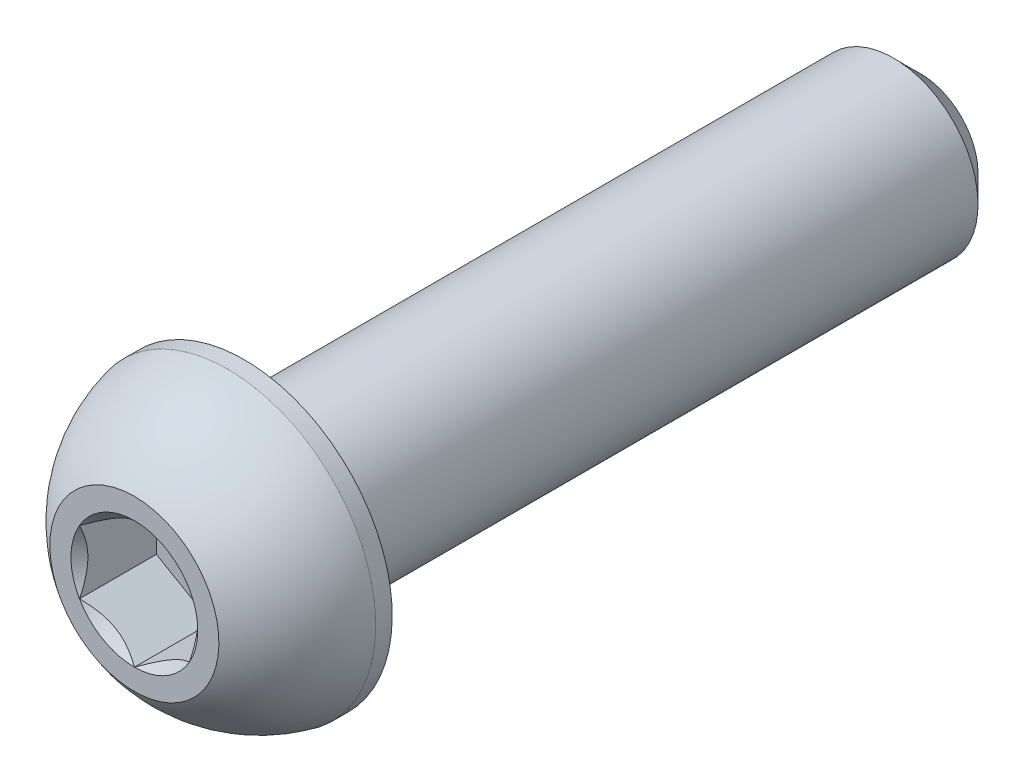
ISO-10303-21;
HEADER;
FILE_DESCRIPTION(('STEP AP214'),'2;1');
FILE_NAME('part.step','',(''),(''),'','','');
FILE_SCHEMA(('AUTOMOTIVE_DESIGN { 1 0 10303 214 1 1 1 1 }'));
ENDSEC;
DATA;
#1=APPLICATION_CONTEXT('core data for automotive mechanical design processes');
#2=APPLICATION_PROTOCOL_DEFINITION('international standard','automotive_design',2000,#1);
#3=PRODUCT_CONTEXT('',#1,'mechanical');
#4=PRODUCT('Part','Part','',(#3));
#5=PRODUCT_RELATED_PRODUCT_CATEGORY('part','',(#4));
#6=PRODUCT_DEFINITION_FORMATION('','',#4);
#7=PRODUCT_DEFINITION_CONTEXT('part definition',#1,'design');
#8=PRODUCT_DEFINITION('design','',#6,#7);
#9=PRODUCT_DEFINITION_SHAPE('','',#8);
#10=(LENGTH_UNIT() NAMED_UNIT(*) SI_UNIT(.MILLI.,.METRE.));
#11=(NAMED_UNIT(*) PLANE_ANGLE_UNIT() SI_UNIT($,.RADIAN.));
#12=(NAMED_UNIT(*) SI_UNIT($,.STERADIAN.) SOLID_ANGLE_UNIT());
#13=UNCERTAINTY_MEASURE_WITH_UNIT(LENGTH_MEASURE(1.E-05),#10,'distance_accuracy_value','');
#14=(GEOMETRIC_REPRESENTATION_CONTEXT(3) GLOBAL_UNCERTAINTY_ASSIGNED_CONTEXT((#13)) GLOBAL_UNIT_ASSIGNED_CONTEXT((#10,
#11,#12)) REPRESENTATION_CONTEXT('',''));
#15=CARTESIAN_POINT('',(0.,0.,0.));
#16=DIRECTION('',(0.,0.,1.));
#17=DIRECTION('',(1.,0.,0.));
#18=AXIS2_PLACEMENT_3D('',#15,#16,#17);
#19=CARTESIAN_POINT('',(0.,0.,4.65));
#20=DIRECTION('',(0.,0.,-1.));
#21=DIRECTION('',(0.,1.,0.));
#22=AXIS2_PLACEMENT_3D('',#19,#20,#21);
#23=PLANE('',#22);
#24=CARTESIAN_POINT('',(0.,0.,4.65));
#25=DIRECTION('',(0.,0.,1.));
#26=DIRECTION('',(1.,0.,0.));
#27=AXIS2_PLACEMENT_3D('',#24,#25,#26);
#28=CIRCLE('',#27,0.750555349946514);
#29=CARTESIAN_POINT('',(0.,0.750555349946514,4.65));
#30=VERTEX_POINT('',#29);
#31=CARTESIAN_POINT('',(-0.65,0.375277674973257,4.65));
#32=VERTEX_POINT('',#31);
#33=EDGE_CURVE('E213',#30,#32,#28,.T.);
#34=ORIENTED_EDGE('',*,*,#33,.F.);
#35=CARTESIAN_POINT('',(0.65,0.375277674973257,4.65));
#36=VERTEX_POINT('',#35);
#37=EDGE_CURVE('E215',#36,#30,#28,.T.);
#38=ORIENTED_EDGE('',*,*,#37,.F.);
#39=CARTESIAN_POINT('',(0.65,-0.375277674973256,4.65));
#40=VERTEX_POINT('',#39);
#41=EDGE_CURVE('E54',#40,#36,#28,.T.);
#42=ORIENTED_EDGE('',*,*,#41,.F.);
#43=CARTESIAN_POINT('',(0.,-0.750555349946513,4.65));
#44=VERTEX_POINT('',#43);
#45=EDGE_CURVE('E61',#44,#40,#28,.T.);
#46=ORIENTED_EDGE('',*,*,#45,.F.);
#47=CARTESIAN_POINT('',(-0.65,-0.375277674973257,4.65));
#48=VERTEX_POINT('',#47);
#49=EDGE_CURVE('E220',#48,#44,#28,.T.);
#50=ORIENTED_EDGE('',*,*,#49,.F.);
#51=EDGE_CURVE('E217',#32,#48,#28,.T.);
#52=ORIENTED_EDGE('',*,*,#51,.F.);
#53=EDGE_LOOP('',(#34,#38,#42,#46,#50,#52));
#54=FACE_BOUND('',#53,.T.);
#55=CARTESIAN_POINT('',(0.,0.,4.65));
#56=DIRECTION('',(0.,0.,1.));
#57=DIRECTION('',(0.,-1.,0.));
#58=AXIS2_PLACEMENT_3D('',#55,#56,#57);
#59=CIRCLE('',#58,0.999999999999998);
#60=CARTESIAN_POINT('',(0.,0.999999999999999,4.65));
#61=VERTEX_POINT('',#60);
#62=EDGE_CURVE('E48',#61,#61,#59,.T.);
#63=ORIENTED_EDGE('',*,*,#62,.T.);
#64=EDGE_LOOP('',(#63));
#65=FACE_BOUND('',#64,.T.);
#66=ADVANCED_FACE('F35',(#54,#65),#23,.F.);
#67=CARTESIAN_POINT('',(0.,0.,3.16424208144796));
#68=DIRECTION('',(0.,0.,1.));
#69=DIRECTION('',(0.,1.,0.));
#70=AXIS2_PLACEMENT_3D('',#67,#68,#69);
#71=SPHERICAL_SURFACE('',#70,1.790942933915);
#72=CARTESIAN_POINT('',(0.,0.,3.545));
#73=DIRECTION('',(0.,0.,1.));
#74=DIRECTION('',(0.,-1.,0.));
#75=AXIS2_PLACEMENT_3D('',#72,#73,#74);
#76=CIRCLE('',#75,1.75);
#77=CARTESIAN_POINT('',(0.,1.75,3.545));
#78=VERTEX_POINT('',#77);
#79=EDGE_CURVE('E160',#78,#78,#76,.T.);
#80=CARTESIAN_POINT('',(0.,0.999999999999999,4.65));
#81=CARTESIAN_POINT('',(0.,1.01182643004196,4.6420401786267));
#82=CARTESIAN_POINT('',(0.,1.02355778185812,4.63393909660818));
#83=CARTESIAN_POINT('',(0.,1.04682372823726,4.61745915548289));
#84=CARTESIAN_POINT('',(0.,1.05835832280024,4.60908029637612));
#85=CARTESIAN_POINT('',(0.,1.08122415387148,4.59204954527652));
#86=CARTESIAN_POINT('',(0.,1.09255539037973,4.58339765328368));
#87=CARTESIAN_POINT('',(0.,1.11500805055768,4.56582577873956));
#88=CARTESIAN_POINT('',(0.,1.12612947422737,4.55690579618828));
#89=CARTESIAN_POINT('',(0.,1.14815616552582,4.53880282434977));
#90=CARTESIAN_POINT('',(0.,1.15906143315459,4.52961983506255));
#91=CARTESIAN_POINT('',(0.,1.18064959458057,4.51099608658973));
#92=CARTESIAN_POINT('',(0.,1.1913324883778,4.50155532740413));
#93=CARTESIAN_POINT('',(0.,1.21246981057064,4.48242142213754));
#94=CARTESIAN_POINT('',(0.,1.22292423896625,4.47272827605656));
#95=CARTESIAN_POINT('',(0.,1.24359866921302,4.45309512413341));
#96=CARTESIAN_POINT('',(0.,1.25381867106419,4.44315511829126));
#97=CARTESIAN_POINT('',(0.,1.2740184207091,4.42303391468225));
#98=CARTESIAN_POINT('',(0.,1.28399816850284,4.4128527169154));
#99=CARTESIAN_POINT('',(0.,1.30371171952532,4.39225493483821));
#100=CARTESIAN_POINT('',(0.,1.31344552275404,4.38183835052787));
#101=CARTESIAN_POINT('',(0.,1.33266163437492,4.36077573495947));
#102=CARTESIAN_POINT('',(0.,1.34214394276706,4.35012970370141));
#103=CARTESIAN_POINT('',(0.,1.36085165784782,4.32861426466644));
#104=CARTESIAN_POINT('',(0.,1.37007706453643,4.31774485688953));
#105=CARTESIAN_POINT('',(0.,1.38826571582979,4.29578886261603));
#106=CARTESIAN_POINT('',(0.,1.39722896043454,4.28470227611943));
#107=CARTESIAN_POINT('',(0.,1.41488817666623,4.26231824604234));
#108=CARTESIAN_POINT('',(0.,1.42358414829318,4.25102080246185));
#109=CARTESIAN_POINT('',(0.,1.44070386007592,4.22822150008468));
#110=CARTESIAN_POINT('',(0.,1.44912760023172,4.216719641288));
#111=CARTESIAN_POINT('',(0.,1.46569804580677,4.19351806690492));
#112=CARTESIAN_POINT('',(0.,1.47384475122603,4.18181835131851));
#113=CARTESIAN_POINT('',(0.,1.48985648202944,4.15822773460149));
#114=CARTESIAN_POINT('',(0.,1.49772150741358,4.14633683347089));
#115=CARTESIAN_POINT('',(0.,1.51316539346376,4.12237062592613));
#116=CARTESIAN_POINT('',(0.,1.5207442541298,4.11029531951197));
#117=CARTESIAN_POINT('',(0.,1.53561148923355,4.08596718680969));
#118=CARTESIAN_POINT('',(0.,1.54289986367127,4.07371436052158));
#119=CARTESIAN_POINT('',(0.,1.5571819704451,4.04903817470386));
#120=CARTESIAN_POINT('',(0.,1.56417570278122,4.03661481517425));
#121=CARTESIAN_POINT('',(0.,1.57786453748518,4.01160464674505));
#122=CARTESIAN_POINT('',(0.,1.58455963985302,3.99901783784545));
#123=CARTESIAN_POINT('',(0.,1.59764739703439,3.97368794774755));
#124=CARTESIAN_POINT('',(0.,1.60404005184792,3.96094486654925));
#125=CARTESIAN_POINT('',(0.,1.61651926879161,3.93530969803253));
#126=CARTESIAN_POINT('',(0.,1.62260583092176,3.92241761071411));
#127=CARTESIAN_POINT('',(0.,1.63446939190682,3.89649178110021));
#128=CARTESIAN_POINT('',(0.,1.64024639076172,3.88345803880473));
#129=CARTESIAN_POINT('',(0.,1.65148753111412,3.85725633115103));
#130=CARTESIAN_POINT('',(0.,1.65695167261162,3.84408836579282));
#131=CARTESIAN_POINT('',(0.,1.66756398257887,3.81762572046729));
#132=CARTESIAN_POINT('',(0.,1.67271215104863,3.80433104049997));
#133=CARTESIAN_POINT('',(0.,1.68268957938988,3.77762254664633));
#134=CARTESIAN_POINT('',(0.,1.68751883926138,3.76420873276001));
#135=CARTESIAN_POINT('',(0.,1.69685569693965,3.73726961975255));
#136=CARTESIAN_POINT('',(0.,1.70136329474643,3.7237443206314));
#137=CARTESIAN_POINT('',(0.,1.71005425727009,3.696589949172));
#138=CARTESIAN_POINT('',(0.,1.71423762198697,3.68296087683374));
#139=CARTESIAN_POINT('',(0.,1.72227773581391,3.65560673101066));
#140=CARTESIAN_POINT('',(0.,1.72613448492398,3.64188165752584));
#141=CARTESIAN_POINT('',(0.,1.73351915771601,3.61434333293356));
#142=CARTESIAN_POINT('',(0.,1.73704708139798,3.60053008182609));
#143=CARTESIAN_POINT('',(0.,1.74377213155194,3.57282328805928));
#144=CARTESIAN_POINT('',(0.,1.74696925802394,3.55892974539993));
#145=CARTESIAN_POINT('',(0.,1.75,3.545));
#146=B_SPLINE_CURVE_WITH_KNOTS('',3,(#80,#81,#82,#83,#84,#85,#86,#87,#88,#89,#90,#91,#92,#93,
#94,#95,#96,#97,#98,#99,#100,#101,#102,#103,#104,#105,#106,#107,#108,#109,#110,#111,#112,#113,
#114,#115,#116,#117,#118,#119,#120,#121,#122,#123,#124,#125,#126,#127,#128,#129,#130,#131,#132,
#133,#134,#135,#136,#137,#138,#139,#140,#141,#142,#143,#144,#145),.UNSPECIFIED.,.F.,.F.,(4,2,2,
2,2,2,2,2,2,2,2,2,2,2,2,2,2,2,2,2,2,2,2,2,2,2,2,2,2,2,2,2,4),(0.,0.0427658943058255,
0.085531788611652,0.128297682917478,0.171063577223304,0.21382947152913,0.256595365834956,
0.299361260140783,0.342127154446609,0.384893048752435,0.427658943058261,0.470424837364087,
0.513190731669913,0.555956625975739,0.598722520281566,0.641488414587392,0.684254308893218,
0.727020203199044,0.76978609750487,0.812551991810697,0.855317886116523,0.898083780422348,
0.940849674728175,0.983615569034001,1.02638146333983,1.06914735764565,1.11191325195148,
1.15467914625731,1.19744504056313,1.24021093486896,1.28297682917478,1.32574272348061,
1.36850861778644),.UNSPECIFIED.);
#147=EDGE_CURVE('BSEAM166',#61,#78,#146,.T.);
#148=ORIENTED_EDGE('',*,*,#62,.F.);
#149=ORIENTED_EDGE('',*,*,#79,.T.);
#150=ORIENTED_EDGE('',*,*,#147,.T.);
#151=ORIENTED_EDGE('',*,*,#147,.F.);
#152=EDGE_LOOP('',(#148,#150,#149,#151));
#153=FACE_BOUND('',#152,.T.);
#154=ADVANCED_FACE('F166',(#153),#71,.T.);
#155=CARTESIAN_POINT('',(0.,0.,4.65));
#156=DIRECTION('',(0.,0.,1.));
#157=DIRECTION('',(0.,-1.,0.));
#158=AXIS2_PLACEMENT_3D('',#155,#156,#157);
#159=CYLINDRICAL_SURFACE('',#158,1.75);
#160=ORIENTED_EDGE('',*,*,#79,.F.);
#161=EDGE_LOOP('',(#160));
#162=FACE_BOUND('',#161,.T.);
#163=CARTESIAN_POINT('',(0.,0.,3.35));
#164=DIRECTION('',(0.,0.,1.));
#165=DIRECTION('',(0.,-1.,0.));
#166=AXIS2_PLACEMENT_3D('',#163,#164,#165);
#167=CIRCLE('',#166,1.75);
#168=CARTESIAN_POINT('',(0.,-1.75,3.35));
#169=VERTEX_POINT('',#168);
#170=EDGE_CURVE('E157',#169,#169,#167,.T.);
#171=ORIENTED_EDGE('',*,*,#170,.T.);
#172=EDGE_LOOP('',(#171));
#173=FACE_BOUND('',#172,.T.);
#174=ADVANCED_FACE('F169',(#162,#173),#159,.T.);
#175=CARTESIAN_POINT('',(0.,0.999999999999998,3.35));
#176=DIRECTION('',(0.,0.,1.));
#177=DIRECTION('',(0.,-1.,0.));
#178=AXIS2_PLACEMENT_3D('',#175,#176,#177);
#179=PLANE('',#178);
#180=ORIENTED_EDGE('',*,*,#170,.F.);
#181=EDGE_LOOP('',(#180));
#182=FACE_BOUND('',#181,.T.);
#183=CARTESIAN_POINT('',(0.,0.,3.35));
#184=DIRECTION('',(0.,0.,1.));
#185=DIRECTION('',(0.,-1.,0.));
#186=AXIS2_PLACEMENT_3D('',#183,#184,#185);
#187=CIRCLE('',#186,0.999999999999997);
#188=CARTESIAN_POINT('',(0.,-0.999999999999997,3.35));
#189=VERTEX_POINT('',#188);
#190=EDGE_CURVE('E154',#189,#189,#187,.T.);
#191=ORIENTED_EDGE('',*,*,#190,.T.);
#192=EDGE_LOOP('',(#191));
#193=FACE_BOUND('',#192,.T.);
#194=ADVANCED_FACE('F174',(#182,#193),#179,.F.);
#195=CARTESIAN_POINT('',(0.,0.,4.65));
#196=DIRECTION('',(0.,0.,1.));
#197=DIRECTION('',(0.,-1.,0.));
#198=AXIS2_PLACEMENT_3D('',#195,#196,#197);
#199=CYLINDRICAL_SURFACE('',#198,0.999999999999998);
#200=ORIENTED_EDGE('',*,*,#190,.F.);
#201=EDGE_LOOP('',(#200));
#202=FACE_BOUND('',#201,.T.);
#203=CARTESIAN_POINT('',(0.,0.,-4.33));
#204=DIRECTION('',(0.,0.,1.));
#205=DIRECTION('',(0.,-1.,0.));
#206=AXIS2_PLACEMENT_3D('',#203,#204,#205);
#207=CIRCLE('',#206,0.999999999999998);
#208=CARTESIAN_POINT('',(0.,-0.999999999999997,-4.33));
#209=VERTEX_POINT('',#208);
#210=EDGE_CURVE('E151',#209,#209,#207,.T.);
#211=ORIENTED_EDGE('',*,*,#210,.T.);
#212=EDGE_LOOP('',(#211));
#213=FACE_BOUND('',#212,.T.);
#214=ADVANCED_FACE('F180',(#202,#213),#199,.T.);
#215=CARTESIAN_POINT('',(0.,0.,-4.65));
#216=DIRECTION('',(0.,0.,1.));
#217=DIRECTION('',(0.,-1.,0.));
#218=AXIS2_PLACEMENT_3D('',#215,#216,#217);
#219=CONICAL_SURFACE('',#218,0.680000000000003,0.78539816339744);
#220=ORIENTED_EDGE('',*,*,#210,.F.);
#221=EDGE_LOOP('',(#220));
#222=FACE_BOUND('',#221,.T.);
#223=CARTESIAN_POINT('',(0.,0.,-4.65));
#224=DIRECTION('',(0.,0.,1.));
#225=DIRECTION('',(0.,-1.,0.));
#226=AXIS2_PLACEMENT_3D('',#223,#224,#225);
#227=CIRCLE('',#226,0.680000000000003);
#228=CARTESIAN_POINT('',(0.,-0.680000000000002,-4.65));
#229=VERTEX_POINT('',#228);
#230=EDGE_CURVE('E138',#229,#229,#227,.T.);
#231=ORIENTED_EDGE('',*,*,#230,.T.);
#232=EDGE_LOOP('',(#231));
#233=FACE_BOUND('',#232,.T.);
#234=ADVANCED_FACE('F186',(#222,#233),#219,.T.);
#235=CARTESIAN_POINT('',(0.,0.,-4.65));
#236=DIRECTION('',(0.,0.,1.));
#237=DIRECTION('',(0.,-1.,0.));
#238=AXIS2_PLACEMENT_3D('',#235,#236,#237);
#239=PLANE('',#238);
#240=ORIENTED_EDGE('',*,*,#230,.F.);
#241=EDGE_LOOP('',(#240));
#242=FACE_BOUND('',#241,.T.);
#243=ADVANCED_FACE('F192',(#242),#239,.F.);
#244=CARTESIAN_POINT('',(0.,0.,4.65));
#245=DIRECTION('',(0.,0.,1.));
#246=DIRECTION('',(1.,0.,0.));
#247=AXIS2_PLACEMENT_3D('',#244,#245,#246);
#248=CONICAL_SURFACE('',#247,0.750555349946514,0.78539816339745);
#249=ORIENTED_EDGE('',*,*,#33,.T.);
#250=CARTESIAN_POINT('',(0.000199999999999804,0.750670820000352,4.65011549669667));
#251=CARTESIAN_POINT('',(-0.0221538754426206,0.737764803996123,4.63721736219155));
#252=CARTESIAN_POINT('',(-0.0448801205326125,0.724643800275747,4.62507515489864));
#253=CARTESIAN_POINT('',(-0.0912219846432823,0.697888312556703,4.60284224486223));
#254=CARTESIAN_POINT('',(-0.114842019040596,0.684251279339146,4.59276392481001));
#255=CARTESIAN_POINT('',(-0.162473808706856,0.656751052753347,4.57550151642337));
#256=CARTESIAN_POINT('',(-0.186473364593086,0.642894902702,4.56827395851558));
#257=CARTESIAN_POINT('',(-0.23498941024521,0.614884150684731,4.55712920200001));
#258=CARTESIAN_POINT('',(-0.259504444041881,0.60073038932303,4.55320370262187));
#259=CARTESIAN_POINT('',(-0.31938440233592,0.566158679282903,4.54822343733471));
#260=CARTESIAN_POINT('',(-0.354889192903235,0.545659978891342,4.54912448479266));
#261=CARTESIAN_POINT('',(-0.425154552317995,0.505092254718525,4.55840856131667));
#262=CARTESIAN_POINT('',(-0.459913930439302,0.485023918403324,4.56680276302966));
#263=CARTESIAN_POINT('',(-0.52095826250894,0.449779956850418,4.5870456785073));
#264=CARTESIAN_POINT('',(-0.547523861415085,0.434442301170771,4.5978384232645));
#265=CARTESIAN_POINT('',(-0.599614154899067,0.404367956205628,4.6221519314496));
#266=CARTESIAN_POINT('',(-0.625141918825036,0.38962949483116,4.63566382100729));
#267=CARTESIAN_POINT('',(-0.6502,0.375162204919419,4.65011549669667));
#268=B_SPLINE_CURVE_WITH_KNOTS('',3,(#250,#251,#252,#253,#254,#255,#256,#257,#258,#259,#260,
#261,#262,#263,#264,#265,#266,#267),.UNSPECIFIED.,.F.,.F.,(4,2,2,2,2,2,2,2,4),(0.,
0.0866236559063441,0.173752711623242,0.259496442803569,0.345023980281753,0.467267720550125,
0.589694037029336,0.687111308755481,0.784215671813666),.UNSPECIFIED.);
#269=EDGE_CURVE('E11',#30,#32,#268,.T.);
#270=ORIENTED_EDGE('',*,*,#269,.F.);
#271=EDGE_LOOP('',(#249,#270));
#272=FACE_BOUND('',#271,.T.);
#273=ADVANCED_FACE('F197',(#272),#248,.F.);
#274=ORIENTED_EDGE('',*,*,#51,.T.);
#275=CARTESIAN_POINT('',(-0.65,-0.748456856202,4.89075069038401));
#276=CARTESIAN_POINT('',(-0.65,-0.711991073878822,4.86328028593362));
#277=CARTESIAN_POINT('',(-0.65,-0.6751396400828,4.8362651954762));
#278=CARTESIAN_POINT('',(-0.65,-0.600031183452824,4.78362934828316));
#279=CARTESIAN_POINT('',(-0.65,-0.561765441270898,4.7580211061291));
#280=CARTESIAN_POINT('',(-0.65,-0.481525479406323,4.70773749376246));
#281=CARTESIAN_POINT('',(-0.65,-0.439464253670488,4.68319880219876));
#282=CARTESIAN_POINT('',(-0.65,-0.353242719412721,4.63831465969864));
#283=CARTESIAN_POINT('',(-0.65,-0.309090130602526,4.61795507248949));
#284=CARTESIAN_POINT('',(-0.65,-0.24281005749867,4.59304872908865));
#285=CARTESIAN_POINT('',(-0.65,-0.22166734982169,4.58590072741471));
#286=CARTESIAN_POINT('',(-0.65,-0.178882845085543,4.57329752945255));
#287=CARTESIAN_POINT('',(-0.65,-0.157241013753964,4.56784244978313));
#288=CARTESIAN_POINT('',(-0.65,-0.0924732258239351,4.55466076531022));
#289=CARTESIAN_POINT('',(-0.65,-0.0486986201802782,4.54979355976944));
#290=CARTESIAN_POINT('',(-0.65,0.0373331587621233,4.54914448923078));
#291=CARTESIAN_POINT('',(-0.65,0.0795879418799263,4.5530403393198));
#292=CARTESIAN_POINT('',(-0.65,0.142230570834974,4.56449232559783));
#293=CARTESIAN_POINT('',(-0.65,0.163174856664668,4.56931456423673));
#294=CARTESIAN_POINT('',(-0.65,0.204615212735413,4.58060009995474));
#295=CARTESIAN_POINT('',(-0.65,0.225111320324616,4.58706325972014));
#296=CARTESIAN_POINT('',(-0.65,0.28963853477237,4.60984409213164));
#297=CARTESIAN_POINT('',(-0.65,0.33274820687505,4.6287572451342));
#298=CARTESIAN_POINT('',(-0.65,0.416943840013233,4.67081128188878));
#299=CARTESIAN_POINT('',(-0.65,0.458021834530769,4.69396735475778));
#300=CARTESIAN_POINT('',(-0.65,0.536529233245989,4.74172663971809));
#301=CARTESIAN_POINT('',(-0.65,0.574038509134621,4.76620075812715));
#302=CARTESIAN_POINT('',(-0.65,0.647609691485456,4.81662345601488));
#303=CARTESIAN_POINT('',(-0.65,0.683680924535919,4.84255834365529));
#304=CARTESIAN_POINT('',(-0.65,0.71935620475114,4.86896687739743));
#305=B_SPLINE_CURVE_WITH_KNOTS('',3,(#275,#276,#277,#278,#279,#280,#281,#282,#283,#284,#285,
#286,#287,#288,#289,#290,#291,#292,#293,#294,#295,#296,#297,#298,#299,#300,#301,#302,#303,#304),
.UNSPECIFIED.,.F.,.F.,(4,2,2,2,2,2,2,2,2,2,2,2,2,2,4),(0.,0.13701403000958,0.275096405762554,
0.421060359835526,0.566522128775094,0.633415056462921,0.700312591121805,0.83153492450834,
0.958010408789903,1.02242898521266,1.08684217280829,1.22766018796413,1.36899252873704,
1.50330165960873,1.63651263433843),.UNSPECIFIED.);
#306=EDGE_CURVE('E219',#32,#48,#305,.F.);
#307=ORIENTED_EDGE('',*,*,#306,.F.);
#308=EDGE_LOOP('',(#274,#307));
#309=FACE_BOUND('',#308,.T.);
#310=ADVANCED_FACE('F202',(#309),#248,.F.);
#311=ORIENTED_EDGE('',*,*,#49,.T.);
#312=CARTESIAN_POINT('',(-0.6502,-0.375162204919418,4.65011549669667));
#313=CARTESIAN_POINT('',(-0.627846124557379,-0.388068220923647,4.63721736219154));
#314=CARTESIAN_POINT('',(-0.605119879467387,-0.401189224644023,4.62507515489864));
#315=CARTESIAN_POINT('',(-0.558778015356717,-0.427944712363067,4.60284224486223));
#316=CARTESIAN_POINT('',(-0.535157980959403,-0.441581745580625,4.59276392481001));
#317=CARTESIAN_POINT('',(-0.487526191293144,-0.469081972166423,4.57550151642337));
#318=CARTESIAN_POINT('',(-0.463526635406913,-0.48293812221777,4.56827395851558));
#319=CARTESIAN_POINT('',(-0.41501058975479,-0.51094887423504,4.55712920200001));
#320=CARTESIAN_POINT('',(-0.390495555958118,-0.525102635596741,4.55320370262187));
#321=CARTESIAN_POINT('',(-0.330615597664079,-0.559674345636868,4.54822343733471));
#322=CARTESIAN_POINT('',(-0.295110807096764,-0.580173046028428,4.54912448479266));
#323=CARTESIAN_POINT('',(-0.224845447682005,-0.620740770201245,4.55840856131667));
#324=CARTESIAN_POINT('',(-0.190086069560698,-0.640809106516446,4.56680276302966));
#325=CARTESIAN_POINT('',(-0.12904173749106,-0.676053068069352,4.5870456785073));
#326=CARTESIAN_POINT('',(-0.102476138584914,-0.691390723748999,4.5978384232645));
#327=CARTESIAN_POINT('',(-0.0503858451009332,-0.721465068714142,4.6221519314496));
#328=CARTESIAN_POINT('',(-0.0248580811749642,-0.73620353008861,4.63566382100729));
#329=CARTESIAN_POINT('',(0.000200000000000108,-0.750670820000351,4.65011549669667));
#330=B_SPLINE_CURVE_WITH_KNOTS('',3,(#312,#313,#314,#315,#316,#317,#318,#319,#320,#321,#322,
#323,#324,#325,#326,#327,#328,#329),.UNSPECIFIED.,.F.,.F.,(4,2,2,2,2,2,2,2,4),(0.,
0.0866236559063448,0.173752711623243,0.259496442803569,0.345023980281753,0.467267720550126,
0.589694037029336,0.687111308755481,0.784215671813666),.UNSPECIFIED.);
#331=EDGE_CURVE('E229',#48,#44,#330,.T.);
#332=ORIENTED_EDGE('',*,*,#331,.F.);
#333=EDGE_LOOP('',(#311,#332));
#334=FACE_BOUND('',#333,.T.);
#335=ADVANCED_FACE('F279',(#334),#248,.F.);
#336=ORIENTED_EDGE('',*,*,#45,.T.);
#337=CARTESIAN_POINT('',(-0.000200000000000003,-0.750670820000351,4.65011549669667));
#338=CARTESIAN_POINT('',(0.0221538754426205,-0.737764803996122,4.63721736219154));
#339=CARTESIAN_POINT('',(0.0448801205326124,-0.724643800275746,4.62507515489864));
#340=CARTESIAN_POINT('',(0.091221984643282,-0.697888312556702,4.60284224486223));
#341=CARTESIAN_POINT('',(0.114842019040596,-0.684251279339145,4.59276392481001));
#342=CARTESIAN_POINT('',(0.162473808706855,-0.656751052753346,4.57550151642337));
#343=CARTESIAN_POINT('',(0.186473364593085,-0.642894902702,4.56827395851558));
#344=CARTESIAN_POINT('',(0.234989410245208,-0.614884150684731,4.55712920200001));
#345=CARTESIAN_POINT('',(0.259504444041879,-0.60073038932303,4.55320370262187));
#346=CARTESIAN_POINT('',(0.319384402335918,-0.566158679282903,4.54822343733471));
#347=CARTESIAN_POINT('',(0.354889192903233,-0.545659978891342,4.54912448479266));
#348=CARTESIAN_POINT('',(0.425154552317992,-0.505092254718525,4.55840856131667));
#349=CARTESIAN_POINT('',(0.459913930439299,-0.485023918403325,4.56680276302966));
#350=CARTESIAN_POINT('',(0.520958262508937,-0.449779956850418,4.5870456785073));
#351=CARTESIAN_POINT('',(0.547523861415084,-0.434442301170771,4.5978384232645));
#352=CARTESIAN_POINT('',(0.599614154899066,-0.404367956205628,4.6221519314496));
#353=CARTESIAN_POINT('',(0.625141918825035,-0.38962949483116,4.63566382100729));
#354=CARTESIAN_POINT('',(0.6502,-0.375162204919419,4.65011549669667));
#355=B_SPLINE_CURVE_WITH_KNOTS('',3,(#337,#338,#339,#340,#341,#342,#343,#344,#345,#346,#347,
#348,#349,#350,#351,#352,#353,#354),.UNSPECIFIED.,.F.,.F.,(4,2,2,2,2,2,2,2,4),(0.,
0.0866236559063442,0.173752711623242,0.259496442803567,0.345023980281751,0.467267720550123,
0.589694037029333,0.687111308755479,0.784215671813665),.UNSPECIFIED.);
#356=EDGE_CURVE('E267',#44,#40,#355,.T.);
#357=ORIENTED_EDGE('',*,*,#356,.F.);
#358=EDGE_LOOP('',(#336,#357));
#359=FACE_BOUND('',#358,.T.);
#360=ADVANCED_FACE('F280',(#359),#248,.F.);
#361=ORIENTED_EDGE('',*,*,#41,.T.);
#362=CARTESIAN_POINT('',(0.65,-0.748456856310897,4.89075069046623));
#363=CARTESIAN_POINT('',(0.65,-0.711991073981599,4.86328028600952));
#364=CARTESIAN_POINT('',(0.65,-0.675139640179433,4.83626519554577));
#365=CARTESIAN_POINT('',(0.65,-0.600031183536872,4.78362934834011));
#366=CARTESIAN_POINT('',(0.65,-0.561765441348501,4.75802110617975));
#367=CARTESIAN_POINT('',(0.65,-0.481525479469872,4.70773749380016));
#368=CARTESIAN_POINT('',(0.65,-0.439464253726391,4.68319880222984));
#369=CARTESIAN_POINT('',(0.65,-0.35324271945268,4.63831465971746));
#370=CARTESIAN_POINT('',(0.65,-0.309090130634193,4.61795507250266));
#371=CARTESIAN_POINT('',(0.65,-0.242810057524099,4.59304872909763));
#372=CARTESIAN_POINT('',(0.65,-0.221667349849732,4.58590072742385));
#373=CARTESIAN_POINT('',(0.65,-0.178882845118893,4.57329752946148));
#374=CARTESIAN_POINT('',(0.65,-0.157241013790008,4.5678424497917));
#375=CARTESIAN_POINT('',(0.65,-0.0924732258678794,4.55466076531677));
#376=CARTESIAN_POINT('',(0.65,-0.0486986202294706,4.54979355977344));
#377=CARTESIAN_POINT('',(0.65,0.0373331587036342,4.54914448922772));
#378=CARTESIAN_POINT('',(0.65,0.0795879418173605,4.55304033931236));
#379=CARTESIAN_POINT('',(0.65,0.142230570766795,4.5644923255833));
#380=CARTESIAN_POINT('',(0.65,0.163174856594624,4.5693145642197));
#381=CARTESIAN_POINT('',(0.65,0.204615212661818,4.58060009993267));
#382=CARTESIAN_POINT('',(0.65,0.225111320249333,4.58706325969551));
#383=CARTESIAN_POINT('',(0.65,0.289638534680692,4.60984409209498));
#384=CARTESIAN_POINT('',(0.65,0.332748206769488,4.62875724508647));
#385=CARTESIAN_POINT('',(0.65,0.41694383988097,4.6708112818177));
#386=CARTESIAN_POINT('',(0.65,0.458021834385694,4.69396735467439));
#387=CARTESIAN_POINT('',(0.65,0.536529233077877,4.74172663961117));
#388=CARTESIAN_POINT('',(0.65,0.574038508956202,4.76620075800911));
#389=CARTESIAN_POINT('',(0.65,0.647609691286781,4.81662345587469));
#390=CARTESIAN_POINT('',(0.65,0.683680924327292,4.84255834350407));
#391=CARTESIAN_POINT('',(0.65,0.719356204532568,4.86896687723526));
#392=B_SPLINE_CURVE_WITH_KNOTS('',3,(#362,#363,#364,#365,#366,#367,#368,#369,#370,#371,#372,
#373,#374,#375,#376,#377,#378,#379,#380,#381,#382,#383,#384,#385,#386,#387,#388,#389,#390,#391),
.UNSPECIFIED.,.F.,.F.,(4,2,2,2,2,2,2,2,2,2,2,2,2,2,4),(0.,0.13701403003566,0.275096405815206,
0.421060359917976,0.566522128887061,0.633415056567334,0.700312591218677,0.831534924590809,
0.958010408859154,1.02242898527478,1.08684217286327,1.22766018796786,1.36899252868916,
1.50330165951672,1.63651263420287),.UNSPECIFIED.);
#393=EDGE_CURVE('E120',#40,#36,#392,.T.);
#394=ORIENTED_EDGE('',*,*,#393,.F.);
#395=EDGE_LOOP('',(#361,#394));
#396=FACE_BOUND('',#395,.T.);
#397=ADVANCED_FACE('F282',(#396),#248,.F.);
#398=ORIENTED_EDGE('',*,*,#37,.T.);
#399=CARTESIAN_POINT('',(0.6502,0.375162204919419,4.65011549669667));
#400=CARTESIAN_POINT('',(0.62784612455738,0.388068220923647,4.63721736219155));
#401=CARTESIAN_POINT('',(0.605119879467388,0.401189224644023,4.62507515489864));
#402=CARTESIAN_POINT('',(0.558778015356718,0.427944712363068,4.60284224486223));
#403=CARTESIAN_POINT('',(0.535157980959404,0.441581745580625,4.59276392481001));
#404=CARTESIAN_POINT('',(0.487526191293144,0.469081972166424,4.57550151642337));
#405=CARTESIAN_POINT('',(0.463526635406914,0.48293812221777,4.56827395851558));
#406=CARTESIAN_POINT('',(0.415010589754791,0.51094887423504,4.55712920200001));
#407=CARTESIAN_POINT('',(0.39049555595812,0.525102635596741,4.55320370262187));
#408=CARTESIAN_POINT('',(0.330615597664081,0.559674345636868,4.54822343733471));
#409=CARTESIAN_POINT('',(0.295110807096766,0.580173046028428,4.54912448479266));
#410=CARTESIAN_POINT('',(0.224845447682006,0.620740770201245,4.55840856131667));
#411=CARTESIAN_POINT('',(0.190086069560699,0.640809106516446,4.56680276302966));
#412=CARTESIAN_POINT('',(0.129041737491061,0.676053068069352,4.5870456785073));
#413=CARTESIAN_POINT('',(0.102476138584915,0.691390723748999,4.5978384232645));
#414=CARTESIAN_POINT('',(0.0503858451009336,0.721465068714143,4.6221519314496));
#415=CARTESIAN_POINT('',(0.0248580811749641,0.736203530088611,4.63566382100729));
#416=CARTESIAN_POINT('',(-0.000200000000000301,0.750670820000352,4.65011549669667));
#417=B_SPLINE_CURVE_WITH_KNOTS('',3,(#399,#400,#401,#402,#403,#404,#405,#406,#407,#408,#409,
#410,#411,#412,#413,#414,#415,#416),.UNSPECIFIED.,.F.,.F.,(4,2,2,2,2,2,2,2,4),(0.,
0.0866236559063442,0.173752711623242,0.259496442803568,0.345023980281752,0.467267720550125,
0.589694037029335,0.68711130875548,0.784215671813666),.UNSPECIFIED.);
#418=EDGE_CURVE('E101',#36,#30,#417,.T.);
#419=ORIENTED_EDGE('',*,*,#418,.F.);
#420=EDGE_LOOP('',(#398,#419));
#421=FACE_BOUND('',#420,.T.);
#422=ADVANCED_FACE('F204',(#421),#248,.F.);
#423=CARTESIAN_POINT('',(0.,0.,3.74));
#424=DIRECTION('',(0.,0.,1.));
#425=DIRECTION('',(1.,0.,0.));
#426=AXIS2_PLACEMENT_3D('',#423,#424,#425);
#427=PLANE('',#426);
#428=DIRECTION('',(-0.866025403784439,0.5,0.));
#429=VECTOR('',#428,1.);
#430=CARTESIAN_POINT('',(0.65,0.375277674973257,3.74));
#431=LINE('',#430,#429);
#432=CARTESIAN_POINT('',(0.65,0.375277674973257,3.74));
#433=VERTEX_POINT('',#432);
#434=CARTESIAN_POINT('',(0.,0.750555349946514,3.74));
#435=VERTEX_POINT('',#434);
#436=EDGE_CURVE('E99',#433,#435,#431,.T.);
#437=ORIENTED_EDGE('',*,*,#436,.T.);
#438=DIRECTION('',(-0.866025403784439,-0.5,0.));
#439=VECTOR('',#438,1.);
#440=CARTESIAN_POINT('',(0.,0.750555349946514,3.74));
#441=LINE('',#440,#439);
#442=CARTESIAN_POINT('',(-0.65,0.375277674973257,3.74));
#443=VERTEX_POINT('',#442);
#444=EDGE_CURVE('E108',#435,#443,#441,.T.);
#445=ORIENTED_EDGE('',*,*,#444,.T.);
#446=DIRECTION('',(0.,-1.,0.));
#447=VECTOR('',#446,1.);
#448=CARTESIAN_POINT('',(-0.65,0.375277674973257,3.74));
#449=LINE('',#448,#447);
#450=CARTESIAN_POINT('',(-0.65,-0.375277674973256,3.74));
#451=VERTEX_POINT('',#450);
#452=EDGE_CURVE('E114',#443,#451,#449,.T.);
#453=ORIENTED_EDGE('',*,*,#452,.T.);
#454=DIRECTION('',(0.866025403784439,-0.5,0.));
#455=VECTOR('',#454,1.);
#456=CARTESIAN_POINT('',(-0.65,-0.375277674973256,3.74));
#457=LINE('',#456,#455);
#458=CARTESIAN_POINT('',(0.,-0.750555349946513,3.74));
#459=VERTEX_POINT('',#458);
#460=EDGE_CURVE('E130',#451,#459,#457,.T.);
#461=ORIENTED_EDGE('',*,*,#460,.T.);
#462=DIRECTION('',(0.866025403784439,0.5,0.));
#463=VECTOR('',#462,1.);
#464=CARTESIAN_POINT('',(0.,-0.750555349946513,3.74));
#465=LINE('',#464,#463);
#466=CARTESIAN_POINT('',(0.65,-0.375277674973256,3.74));
#467=VERTEX_POINT('',#466);
#468=EDGE_CURVE('E133',#459,#467,#465,.T.);
#469=ORIENTED_EDGE('',*,*,#468,.T.);
#470=DIRECTION('',(0.,1.,0.));
#471=VECTOR('',#470,1.);
#472=CARTESIAN_POINT('',(0.65,-0.375277674973256,3.74));
#473=LINE('',#472,#471);
#474=EDGE_CURVE('E105',#467,#433,#473,.T.);
#475=ORIENTED_EDGE('',*,*,#474,.T.);
#476=EDGE_LOOP('',(#437,#445,#453,#461,#469,#475));
#477=FACE_BOUND('',#476,.T.);
#478=ADVANCED_FACE('F116',(#477),#427,.T.);
#479=CARTESIAN_POINT('',(0.,0.750555349946514,3.74));
#480=DIRECTION('',(-0.5,0.866025403784439,0.));
#481=DIRECTION('',(-0.866025403784439,-0.5,0.));
#482=AXIS2_PLACEMENT_3D('',#479,#480,#481);
#483=PLANE('',#482);
#484=DIRECTION('',(0.,0.,1.));
#485=VECTOR('',#484,1.);
#486=CARTESIAN_POINT('',(0.,0.750555349946514,3.74));
#487=LINE('',#486,#485);
#488=EDGE_CURVE('E94',#435,#30,#487,.T.);
#489=ORIENTED_EDGE('',*,*,#488,.T.);
#490=ORIENTED_EDGE('',*,*,#269,.T.);
#491=DIRECTION('',(0.,0.,1.));
#492=VECTOR('',#491,1.);
#493=CARTESIAN_POINT('',(-0.65,0.375277674973257,3.74));
#494=LINE('',#493,#492);
#495=EDGE_CURVE('E104',#443,#32,#494,.T.);
#496=ORIENTED_EDGE('',*,*,#495,.F.);
#497=ORIENTED_EDGE('',*,*,#444,.F.);
#498=EDGE_LOOP('',(#489,#490,#496,#497));
#499=FACE_BOUND('',#498,.T.);
#500=ADVANCED_FACE('F109',(#499),#483,.F.);
#501=CARTESIAN_POINT('',(-0.65,0.375277674973257,3.74));
#502=DIRECTION('',(-1.,0.,0.));
#503=DIRECTION('',(0.,-1.,0.));
#504=AXIS2_PLACEMENT_3D('',#501,#502,#503);
#505=PLANE('',#504);
#506=ORIENTED_EDGE('',*,*,#495,.T.);
#507=ORIENTED_EDGE('',*,*,#306,.T.);
#508=DIRECTION('',(0.,0.,1.));
#509=VECTOR('',#508,1.);
#510=CARTESIAN_POINT('',(-0.65,-0.375277674973256,3.74));
#511=LINE('',#510,#509);
#512=EDGE_CURVE('E145',#451,#48,#511,.T.);
#513=ORIENTED_EDGE('',*,*,#512,.F.);
#514=ORIENTED_EDGE('',*,*,#452,.F.);
#515=EDGE_LOOP('',(#506,#507,#513,#514));
#516=FACE_BOUND('',#515,.T.);
#517=ADVANCED_FACE('F238',(#516),#505,.F.);
#518=CARTESIAN_POINT('',(-0.65,-0.375277674973256,3.74));
#519=DIRECTION('',(-0.5,-0.866025403784439,0.));
#520=DIRECTION('',(0.866025403784439,-0.5,0.));
#521=AXIS2_PLACEMENT_3D('',#518,#519,#520);
#522=PLANE('',#521);
#523=ORIENTED_EDGE('',*,*,#512,.T.);
#524=ORIENTED_EDGE('',*,*,#331,.T.);
#525=DIRECTION('',(0.,0.,1.));
#526=VECTOR('',#525,1.);
#527=CARTESIAN_POINT('',(0.,-0.750555349946513,3.74));
#528=LINE('',#527,#526);
#529=EDGE_CURVE('E142',#459,#44,#528,.T.);
#530=ORIENTED_EDGE('',*,*,#529,.F.);
#531=ORIENTED_EDGE('',*,*,#460,.F.);
#532=EDGE_LOOP('',(#523,#524,#530,#531));
#533=FACE_BOUND('',#532,.T.);
#534=ADVANCED_FACE('F241',(#533),#522,.F.);
#535=CARTESIAN_POINT('',(0.,-0.750555349946513,3.74));
#536=DIRECTION('',(0.5,-0.866025403784439,0.));
#537=DIRECTION('',(0.866025403784439,0.5,0.));
#538=AXIS2_PLACEMENT_3D('',#535,#536,#537);
#539=PLANE('',#538);
#540=ORIENTED_EDGE('',*,*,#529,.T.);
#541=ORIENTED_EDGE('',*,*,#356,.T.);
#542=DIRECTION('',(0.,0.,1.));
#543=VECTOR('',#542,1.);
#544=CARTESIAN_POINT('',(0.65,-0.375277674973256,3.74));
#545=LINE('',#544,#543);
#546=EDGE_CURVE('E139',#467,#40,#545,.T.);
#547=ORIENTED_EDGE('',*,*,#546,.F.);
#548=ORIENTED_EDGE('',*,*,#468,.F.);
#549=EDGE_LOOP('',(#540,#541,#547,#548));
#550=FACE_BOUND('',#549,.T.);
#551=ADVANCED_FACE('F253',(#550),#539,.F.);
#552=CARTESIAN_POINT('',(0.65,-0.375277674973256,3.74));
#553=DIRECTION('',(1.,0.,0.));
#554=DIRECTION('',(0.,1.,0.));
#555=AXIS2_PLACEMENT_3D('',#552,#553,#554);
#556=PLANE('',#555);
#557=ORIENTED_EDGE('',*,*,#546,.T.);
#558=ORIENTED_EDGE('',*,*,#393,.T.);
#559=DIRECTION('',(0.,0.,1.));
#560=VECTOR('',#559,1.);
#561=CARTESIAN_POINT('',(0.65,0.375277674973257,3.74));
#562=LINE('',#561,#560);
#563=EDGE_CURVE('E136',#433,#36,#562,.T.);
#564=ORIENTED_EDGE('',*,*,#563,.F.);
#565=ORIENTED_EDGE('',*,*,#474,.F.);
#566=EDGE_LOOP('',(#557,#558,#564,#565));
#567=FACE_BOUND('',#566,.T.);
#568=ADVANCED_FACE('F249',(#567),#556,.F.);
#569=CARTESIAN_POINT('',(0.65,0.375277674973257,3.74));
#570=DIRECTION('',(0.5,0.866025403784439,0.));
#571=DIRECTION('',(-0.866025403784439,0.5,0.));
#572=AXIS2_PLACEMENT_3D('',#569,#570,#571);
#573=PLANE('',#572);
#574=ORIENTED_EDGE('',*,*,#563,.T.);
#575=ORIENTED_EDGE('',*,*,#418,.T.);
#576=ORIENTED_EDGE('',*,*,#488,.F.);
#577=ORIENTED_EDGE('',*,*,#436,.F.);
#578=EDGE_LOOP('',(#574,#575,#576,#577));
#579=FACE_BOUND('',#578,.T.);
#580=ADVANCED_FACE('F97',(#579),#573,.F.);
#581=CLOSED_SHELL('',(#66,#154,#174,#194,#214,#234,#243,#273,#310,#335,#360,#397,#422,#478,#500,
#517,#534,#551,#568,#580));
#582=MANIFOLD_SOLID_BREP('B2',#581);
#583=ADVANCED_BREP_SHAPE_REPRESENTATION('',(#18,#582),#14);
#584=SHAPE_DEFINITION_REPRESENTATION(#9,#583);
ENDSEC;
END-ISO-10303-21;
